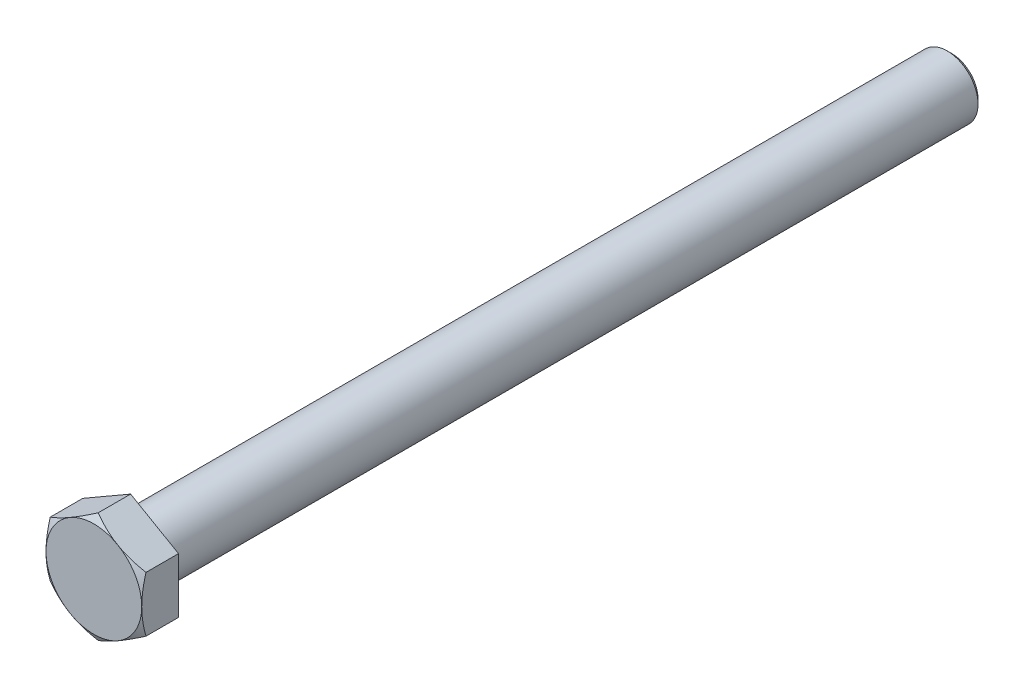
ISO-10303-21;
HEADER;
FILE_DESCRIPTION(('STEP AP214'),'2;1');
FILE_NAME('part.step','',(''),(''),'','','');
FILE_SCHEMA(('AUTOMOTIVE_DESIGN { 1 0 10303 214 1 1 1 1 }'));
ENDSEC;
DATA;
#1=APPLICATION_CONTEXT('core data for automotive mechanical design processes');
#2=APPLICATION_PROTOCOL_DEFINITION('international standard','automotive_design',2000,#1);
#3=PRODUCT_CONTEXT('',#1,'mechanical');
#4=PRODUCT('Part','Part','',(#3));
#5=PRODUCT_RELATED_PRODUCT_CATEGORY('part','',(#4));
#6=PRODUCT_DEFINITION_FORMATION('','',#4);
#7=PRODUCT_DEFINITION_CONTEXT('part definition',#1,'design');
#8=PRODUCT_DEFINITION('design','',#6,#7);
#9=PRODUCT_DEFINITION_SHAPE('','',#8);
#10=(LENGTH_UNIT() NAMED_UNIT(*) SI_UNIT(.MILLI.,.METRE.));
#11=(NAMED_UNIT(*) PLANE_ANGLE_UNIT() SI_UNIT($,.RADIAN.));
#12=(NAMED_UNIT(*) SI_UNIT($,.STERADIAN.) SOLID_ANGLE_UNIT());
#13=UNCERTAINTY_MEASURE_WITH_UNIT(LENGTH_MEASURE(1.E-05),#10,'distance_accuracy_value','');
#14=(GEOMETRIC_REPRESENTATION_CONTEXT(3) GLOBAL_UNCERTAINTY_ASSIGNED_CONTEXT((#13)) GLOBAL_UNIT_ASSIGNED_CONTEXT((#10,
#11,#12)) REPRESENTATION_CONTEXT('',''));
#15=CARTESIAN_POINT('',(0.,0.,0.));
#16=DIRECTION('',(0.,0.,1.));
#17=DIRECTION('',(1.,0.,0.));
#18=AXIS2_PLACEMENT_3D('',#15,#16,#17);
#19=CARTESIAN_POINT('',(0.,0.,0.));
#20=DIRECTION('',(0.,0.,1.));
#21=DIRECTION('',(1.,0.,0.));
#22=AXIS2_PLACEMENT_3D('',#19,#20,#21);
#23=PLANE('',#22);
#24=CARTESIAN_POINT('',(0.,0.,0.));
#25=DIRECTION('',(0.,0.,1.));
#26=DIRECTION('',(1.,0.,0.));
#27=AXIS2_PLACEMENT_3D('',#24,#25,#26);
#28=CIRCLE('',#27,6.6);
#29=CARTESIAN_POINT('',(6.6,0.,0.));
#30=VERTEX_POINT('',#29);
#31=EDGE_CURVE('E198',#30,#30,#28,.T.);
#32=ORIENTED_EDGE('',*,*,#31,.T.);
#33=EDGE_LOOP('',(#32));
#34=FACE_BOUND('',#33,.T.);
#35=CARTESIAN_POINT('',(0.,0.,0.));
#36=DIRECTION('',(0.,0.,1.));
#37=DIRECTION('',(1.,0.,0.));
#38=AXIS2_PLACEMENT_3D('',#35,#36,#37);
#39=CIRCLE('',#38,8.7);
#40=CARTESIAN_POINT('',(8.7,0.,0.));
#41=VERTEX_POINT('',#40);
#42=EDGE_CURVE('E413',#41,#41,#39,.T.);
#43=ORIENTED_EDGE('',*,*,#42,.F.);
#44=EDGE_LOOP('',(#43));
#45=FACE_BOUND('',#44,.T.);
#46=ADVANCED_FACE('F59',(#34,#45),#23,.F.);
#47=CARTESIAN_POINT('',(0.,-1.33226762955019E-12,-0.599999999999934));
#48=DIRECTION('',(0.,0.,1.));
#49=DIRECTION('',(1.,0.,0.));
#50=AXIS2_PLACEMENT_3D('',#47,#48,#49);
#51=TOROIDAL_SURFACE('',#50,6.6,0.6);
#52=ORIENTED_EDGE('',*,*,#31,.F.);
#53=EDGE_LOOP('',(#52));
#54=FACE_BOUND('',#53,.T.);
#55=CARTESIAN_POINT('',(0.,-1.33226762955019E-12,-0.599999999999934));
#56=DIRECTION('',(0.,0.,1.));
#57=DIRECTION('',(1.,0.,0.));
#58=AXIS2_PLACEMENT_3D('',#55,#56,#57);
#59=CIRCLE('',#58,6.00000000000001);
#60=CARTESIAN_POINT('',(6.00000000000001,-1.33226762955019E-12,-0.599999999999937));
#61=VERTEX_POINT('',#60);
#62=EDGE_CURVE('E202',#61,#61,#59,.T.);
#63=ORIENTED_EDGE('',*,*,#62,.T.);
#64=EDGE_LOOP('',(#63));
#65=FACE_BOUND('',#64,.T.);
#66=ADVANCED_FACE('F294',(#54,#65),#51,.F.);
#67=CARTESIAN_POINT('',(0.,0.,0.));
#68=DIRECTION('',(0.,0.,1.));
#69=DIRECTION('',(1.,0.,0.));
#70=AXIS2_PLACEMENT_3D('',#67,#68,#69);
#71=CYLINDRICAL_SURFACE('',#70,6.00000000000001);
#72=ORIENTED_EDGE('',*,*,#62,.F.);
#73=EDGE_LOOP('',(#72));
#74=FACE_BOUND('',#73,.T.);
#75=CARTESIAN_POINT('',(-2.22044604925031E-13,8.88178419700125E-13,-159.099999999996));
#76=DIRECTION('',(0.,0.,1.));
#77=DIRECTION('',(1.,0.,0.));
#78=AXIS2_PLACEMENT_3D('',#75,#76,#77);
#79=CIRCLE('',#78,6.00000000000002);
#80=CARTESIAN_POINT('',(5.9999999999998,8.88178419700125E-13,-159.099999999996));
#81=VERTEX_POINT('',#80);
#82=EDGE_CURVE('E206',#81,#81,#79,.T.);
#83=ORIENTED_EDGE('',*,*,#82,.T.);
#84=EDGE_LOOP('',(#83));
#85=FACE_BOUND('',#84,.T.);
#86=ADVANCED_FACE('F300',(#74,#85),#71,.T.);
#87=CARTESIAN_POINT('',(4.44089209850063E-13,4.21884749357559E-12,-159.999999999996));
#88=DIRECTION('',(0.,0.,1.));
#89=DIRECTION('',(1.,0.,0.));
#90=AXIS2_PLACEMENT_3D('',#87,#88,#89);
#91=CONICAL_SURFACE('',#90,5.1,0.785398163397439);
#92=ORIENTED_EDGE('',*,*,#82,.F.);
#93=EDGE_LOOP('',(#92));
#94=FACE_BOUND('',#93,.T.);
#95=CARTESIAN_POINT('',(4.44089209850063E-13,4.21884749357559E-12,-159.999999999996));
#96=DIRECTION('',(0.,0.,1.));
#97=DIRECTION('',(1.,0.,0.));
#98=AXIS2_PLACEMENT_3D('',#95,#96,#97);
#99=CIRCLE('',#98,5.1);
#100=CARTESIAN_POINT('',(5.10000000000044,4.21884749357559E-12,-159.999999999996));
#101=VERTEX_POINT('',#100);
#102=EDGE_CURVE('E168',#101,#101,#99,.T.);
#103=ORIENTED_EDGE('',*,*,#102,.T.);
#104=EDGE_LOOP('',(#103));
#105=FACE_BOUND('',#104,.T.);
#106=ADVANCED_FACE('F503',(#94,#105),#91,.T.);
#107=CARTESIAN_POINT('',(-4.44089209850063E-13,5.10000000000055,-159.999999999997));
#108=DIRECTION('',(0.,0.,1.));
#109=DIRECTION('',(1.,0.,0.));
#110=AXIS2_PLACEMENT_3D('',#107,#108,#109);
#111=PLANE('',#110);
#112=ORIENTED_EDGE('',*,*,#102,.F.);
#113=EDGE_LOOP('',(#112));
#114=FACE_BOUND('',#113,.T.);
#115=ADVANCED_FACE('F470',(#114),#111,.F.);
#116=CARTESIAN_POINT('',(2.22044604925031E-13,10.7791295257711,0.14999999999965));
#117=DIRECTION('',(0.,0.,-1.));
#118=DIRECTION('',(-1.,0.,0.));
#119=AXIS2_PLACEMENT_3D('',#116,#117,#118);
#120=PLANE('',#119);
#121=CARTESIAN_POINT('',(6.66133814775094E-13,1.33226762955019E-12,0.150000000000095));
#122=DIRECTION('',(0.,0.,1.));
#123=DIRECTION('',(1.,0.,0.));
#124=AXIS2_PLACEMENT_3D('',#121,#122,#123);
#125=CIRCLE('',#124,8.78660254037844);
#126=CARTESIAN_POINT('',(8.78660254037911,1.33226762955019E-12,0.15000000000009));
#127=VERTEX_POINT('',#126);
#128=EDGE_CURVE('E407',#127,#127,#125,.T.);
#129=ORIENTED_EDGE('',*,*,#128,.T.);
#130=EDGE_LOOP('',(#129));
#131=FACE_BOUND('',#130,.T.);
#132=DIRECTION('',(0.866025403784439,-0.5,0.));
#133=VECTOR('',#132,1.);
#134=CARTESIAN_POINT('',(9.33500000000009,5.38956476288632,0.150000000003203));
#135=LINE('',#134,#133);
#136=CARTESIAN_POINT('',(2.22044604925031E-13,10.7791295257711,0.14999999999965));
#137=VERTEX_POINT('',#136);
#138=CARTESIAN_POINT('',(9.33500000000009,5.38956476288632,0.150000000003203));
#139=VERTEX_POINT('',#138);
#140=EDGE_CURVE('E87',#137,#139,#135,.T.);
#141=ORIENTED_EDGE('',*,*,#140,.T.);
#142=DIRECTION('',(0.,-1.,0.));
#143=VECTOR('',#142,1.);
#144=CARTESIAN_POINT('',(9.33500000000032,-5.38956476288432,0.150000000000095));
#145=LINE('',#144,#143);
#146=CARTESIAN_POINT('',(9.33500000000032,-5.38956476288432,0.150000000000095));
#147=VERTEX_POINT('',#146);
#148=EDGE_CURVE('E11',#139,#147,#145,.T.);
#149=ORIENTED_EDGE('',*,*,#148,.T.);
#150=DIRECTION('',(-0.866025403784441,-0.5,0.));
#151=VECTOR('',#150,1.);
#152=CARTESIAN_POINT('',(4.44089209850063E-13,-10.77912952577,0.150000000003647));
#153=LINE('',#152,#151);
#154=CARTESIAN_POINT('',(4.44089209850063E-13,-10.77912952577,0.150000000003647));
#155=VERTEX_POINT('',#154);
#156=EDGE_CURVE('E218',#147,#155,#153,.T.);
#157=ORIENTED_EDGE('',*,*,#156,.T.);
#158=DIRECTION('',(-0.866025403784439,0.5,0.));
#159=VECTOR('',#158,1.);
#160=CARTESIAN_POINT('',(-9.33499999999965,-5.38956476288321,0.150000000000095));
#161=LINE('',#160,#159);
#162=CARTESIAN_POINT('',(-9.33499999999965,-5.38956476288321,0.150000000000095));
#163=VERTEX_POINT('',#162);
#164=EDGE_CURVE('E215',#155,#163,#161,.T.);
#165=ORIENTED_EDGE('',*,*,#164,.T.);
#166=DIRECTION('',(0.,1.,0.));
#167=VECTOR('',#166,1.);
#168=CARTESIAN_POINT('',(-9.33499999999965,5.38956476288588,0.14999999999965));
#169=LINE('',#168,#167);
#170=CARTESIAN_POINT('',(-9.33499999999965,5.38956476288588,0.14999999999965));
#171=VERTEX_POINT('',#170);
#172=EDGE_CURVE('E152',#163,#171,#169,.T.);
#173=ORIENTED_EDGE('',*,*,#172,.T.);
#174=DIRECTION('',(0.86602540378444,0.5,0.));
#175=VECTOR('',#174,1.);
#176=CARTESIAN_POINT('',(2.22044604925031E-13,10.7791295257711,0.14999999999965));
#177=LINE('',#176,#175);
#178=EDGE_CURVE('E149',#171,#137,#177,.T.);
#179=ORIENTED_EDGE('',*,*,#178,.T.);
#180=EDGE_LOOP('',(#141,#149,#157,#165,#173,#179));
#181=FACE_BOUND('',#180,.T.);
#182=ADVANCED_FACE('F150',(#131,#181),#120,.T.);
#183=CARTESIAN_POINT('',(6.66133814775094E-13,1.33226762955019E-12,0.150000000000095));
#184=DIRECTION('',(0.,0.,1.));
#185=DIRECTION('',(1.,0.,0.));
#186=AXIS2_PLACEMENT_3D('',#183,#184,#185);
#187=CONICAL_SURFACE('',#186,8.78660254037844,0.5235987755983);
#188=ORIENTED_EDGE('',*,*,#42,.T.);
#189=EDGE_LOOP('',(#188));
#190=FACE_BOUND('',#189,.T.);
#191=ORIENTED_EDGE('',*,*,#128,.F.);
#192=EDGE_LOOP('',(#191));
#193=FACE_BOUND('',#192,.T.);
#194=ADVANCED_FACE('F244',(#190,#193),#187,.T.);
#195=CARTESIAN_POINT('',(9.33500000000009,-5.38956476288388,7.31999999999999));
#196=DIRECTION('',(-1.,0.,0.));
#197=DIRECTION('',(0.,-1.,0.));
#198=AXIS2_PLACEMENT_3D('',#195,#196,#197);
#199=PLANE('',#198);
#200=CARTESIAN_POINT('',(9.33500000000054,-14.2939200065677,2.8529532059296));
#201=CARTESIAN_POINT('',(9.33500000000026,-14.0889979748914,2.95200947810429));
#202=CARTESIAN_POINT('',(9.33500000000014,-13.883828250142,3.05055309057784));
#203=CARTESIAN_POINT('',(9.33500000000006,-13.4729410981214,3.24649731903083));
#204=CARTESIAN_POINT('',(9.33500000000008,-13.2672236648763,3.34389792248024));
#205=CARTESIAN_POINT('',(9.33500000000013,-12.6491110540914,3.63423693699367));
#206=CARTESIAN_POINT('',(9.33500000000011,-12.2358221904241,3.82528025363531));
#207=CARTESIAN_POINT('',(9.33500000000009,-11.4040234451094,4.20217310927));
#208=CARTESIAN_POINT('',(9.33500000000009,-10.9854972201124,4.38798667006424));
#209=CARTESIAN_POINT('',(9.3350000000001,-10.1450055951409,4.75163580727645));
#210=CARTESIAN_POINT('',(9.3350000000001,-9.72304037579275,4.92947179954992));
#211=CARTESIAN_POINT('',(9.33500000000009,-8.86976005799748,5.27715066645133));
#212=CARTESIAN_POINT('',(9.33500000000009,-8.43839377157332,5.44686860657153));
#213=CARTESIAN_POINT('',(9.3350000000001,-7.57057438678958,5.77301256488047));
#214=CARTESIAN_POINT('',(9.33500000000013,-7.13412072861191,5.92943710424788));
#215=CARTESIAN_POINT('',(9.33500000000006,-6.25632320664925,6.22479025996746));
#216=CARTESIAN_POINT('',(9.33499999999997,-5.81499199640056,6.36375607259893));
#217=CARTESIAN_POINT('',(9.33500000000021,-4.92607133486448,6.61968098547111));
#218=CARTESIAN_POINT('',(9.33500000000055,-4.47848391093586,6.73664704501688));
#219=CARTESIAN_POINT('',(9.33500000000052,-3.57667031207618,6.94288552890604));
#220=CARTESIAN_POINT('',(9.33500000000017,-3.1224424031369,7.03215057946406));
#221=CARTESIAN_POINT('',(9.33500000000005,-2.43710350689098,7.14080282116408));
#222=CARTESIAN_POINT('',(9.33500000000008,-2.20796291905894,7.17281503726107));
#223=CARTESIAN_POINT('',(9.3350000000001,-1.74860743174241,7.22779448910407));
#224=CARTESIAN_POINT('',(9.33500000000009,-1.51839264089987,7.25076262030647));
#225=CARTESIAN_POINT('',(9.33500000000008,-1.05866032543408,7.28703579916516));
#226=CARTESIAN_POINT('',(9.33500000000009,-0.829147554395675,7.30040085149519));
#227=CARTESIAN_POINT('',(9.33500000000009,-0.369761997155168,7.31739721140065));
#228=CARTESIAN_POINT('',(9.33500000000009,-0.139889215667101,7.321028645381));
#229=CARTESIAN_POINT('',(9.33500000000009,0.319737952099851,7.31847123986254));
#230=CARTESIAN_POINT('',(9.33500000000008,0.549492353500274,7.31228515639608));
#231=CARTESIAN_POINT('',(9.33500000000009,1.00854016574372,7.29024654738607));
#232=CARTESIAN_POINT('',(9.33500000000009,1.23783355299172,7.27439353911284));
#233=CARTESIAN_POINT('',(9.33500000000009,1.79357012506142,7.22458635459068));
#234=CARTESIAN_POINT('',(9.33500000000009,2.11958632863987,7.18578870330793));
#235=CARTESIAN_POINT('',(9.33500000000008,2.76912050376885,7.09080439036387));
#236=CARTESIAN_POINT('',(9.33500000000008,3.09263776869649,7.03461298239628));
#237=CARTESIAN_POINT('',(9.33500000000008,3.73690716836883,6.90683408562757));
#238=CARTESIAN_POINT('',(9.33500000000008,4.05765638834857,6.83523203973513));
#239=CARTESIAN_POINT('',(9.33500000000008,4.69585477456167,6.67881653034317));
#240=CARTESIAN_POINT('',(9.33500000000008,5.0133042486738,6.59400431142267));
#241=CARTESIAN_POINT('',(9.33500000000008,5.65272185352892,6.41098051072647));
#242=CARTESIAN_POINT('',(9.33500000000008,5.97461000805024,6.31249144069503));
#243=CARTESIAN_POINT('',(9.33500000000008,6.61498395116311,6.10578201115797));
#244=CARTESIAN_POINT('',(9.33500000000009,6.93347191931141,5.99756836371273));
#245=CARTESIAN_POINT('',(9.33500000000007,7.56576751363467,5.77364503844938));
#246=CARTESIAN_POINT('',(9.33500000000003,7.87959139359984,5.65798098174515));
#247=CARTESIAN_POINT('',(9.33500000000012,8.50480431543608,5.41986404687489));
#248=CARTESIAN_POINT('',(9.33500000000024,8.81619231437585,5.29740842489885));
#249=CARTESIAN_POINT('',(9.33500000000054,9.12644907510129,5.17222885599011));
#250=B_SPLINE_CURVE_WITH_KNOTS('',3,(#200,#201,#202,#203,#204,#205,#206,#207,#208,#209,#210,
#211,#212,#213,#214,#215,#216,#217,#218,#219,#220,#221,#222,#223,#224,#225,#226,#227,#228,#229,
#230,#231,#232,#233,#234,#235,#236,#237,#238,#239,#240,#241,#242,#243,#244,#245,#246,#247,#248,
#249),.UNSPECIFIED.,.F.,.F.,(4,2,2,2,2,2,2,2,2,2,2,2,2,2,2,2,2,2,2,2,2,2,2,2,4),(0.,
0.682821242992999,1.36564996430013,2.73152951663889,4.10522544602877,5.47884968385028,
6.86933776425735,8.2599803272584,9.64760794835924,11.0347958724528,12.4223527386741,
13.1163000222239,13.8101785806467,14.4996828280981,15.1891781213094,15.8784798895046,
16.5678160816441,17.5522174713337,18.5368877158492,19.5224922074124,20.5080038976517,
21.5176726092945,22.5266497067156,23.5299476031853,24.533653829807),.UNSPECIFIED.);
#251=CARTESIAN_POINT('',(9.33500000000032,-5.38956476288099,6.48623142955174));
#252=VERTEX_POINT('',#251);
#253=CARTESIAN_POINT('',(9.33500000000187,3.33066907387547E-12,7.31999999999999));
#254=VERTEX_POINT('',#253);
#255=EDGE_CURVE('E372',#252,#254,#250,.T.);
#256=ORIENTED_EDGE('',*,*,#255,.F.);
#257=DIRECTION('',(0.,0.,-1.));
#258=VECTOR('',#257,1.);
#259=CARTESIAN_POINT('',(9.33500000000009,-5.38956476288388,7.31999999999999));
#260=LINE('',#259,#258);
#261=EDGE_CURVE('E192',#252,#147,#260,.T.);
#262=ORIENTED_EDGE('',*,*,#261,.T.);
#263=ORIENTED_EDGE('',*,*,#148,.F.);
#264=DIRECTION('',(0.,0.,-1.));
#265=VECTOR('',#264,1.);
#266=CARTESIAN_POINT('',(9.33500000000054,5.38956476288943,7.32000000000355));
#267=LINE('',#266,#265);
#268=CARTESIAN_POINT('',(9.33500000000032,5.38956476288588,6.48623142955529));
#269=VERTEX_POINT('',#268);
#270=EDGE_CURVE('E166',#269,#139,#267,.T.);
#271=ORIENTED_EDGE('',*,*,#270,.F.);
#272=EDGE_CURVE('E249',#254,#269,#250,.T.);
#273=ORIENTED_EDGE('',*,*,#272,.F.);
#274=EDGE_LOOP('',(#256,#262,#263,#271,#273));
#275=FACE_BOUND('',#274,.T.);
#276=ADVANCED_FACE('F305',(#275),#199,.F.);
#277=CARTESIAN_POINT('',(4.44089209850063E-13,-10.7791295257693,7.32000000000355));
#278=DIRECTION('',(-0.5,0.86602540378444,0.));
#279=DIRECTION('',(-0.866025403784441,-0.5,0.));
#280=AXIS2_PLACEMENT_3D('',#277,#278,#279);
#281=PLANE('',#280);
#282=CARTESIAN_POINT('',(-0.000199999998118372,-10.7792449958235,6.48616476181374));
#283=CARTESIAN_POINT('',(0.205003739619134,-10.660770561516,6.55455498932982));
#284=CARTESIAN_POINT('',(0.410972586004757,-10.5418543926103,6.61984121047611));
#285=CARTESIAN_POINT('',(0.824561997185974,-10.3030684347306,6.74334436956233));
#286=CARTESIAN_POINT('',(1.03218308144235,-10.1831983458458,6.80155898242845));
#287=CARTESIAN_POINT('',(1.65839174727719,-9.82165660405732,6.96446882046107));
#288=CARTESIAN_POINT('',(2.07945137461496,-9.5785577148689,7.05713121773367));
#289=CARTESIAN_POINT('',(2.70954783258556,-9.21477135524413,7.16578659054222));
#290=CARTESIAN_POINT('',(2.91670220163521,-9.09517072450952,7.19673843664825));
#291=CARTESIAN_POINT('',(3.33197005561756,-8.855415717227,7.24864273857334));
#292=CARTESIAN_POINT('',(3.54008355893243,-8.73526133006613,7.26959500193518));
#293=CARTESIAN_POINT('',(3.95665771618434,-8.49475212823938,7.3009632905055));
#294=CARTESIAN_POINT('',(4.16511766131753,-8.3743977228016,7.31139183642488));
#295=CARTESIAN_POINT('',(4.5822301078775,-8.13357773949754,7.32149109381367));
#296=CARTESIAN_POINT('',(4.79088260315593,-8.01311216518102,7.32116213765502));
#297=CARTESIAN_POINT('',(5.1809638145184,-7.78789867279515,7.31049475072296));
#298=CARTESIAN_POINT('',(5.36242006195917,-7.68313485948946,7.30145760928891));
#299=CARTESIAN_POINT('',(5.72490816972206,-7.4738522528948,7.27542267819159));
#300=CARTESIAN_POINT('',(5.90593999911289,-7.36933347746402,7.25842432539975));
#301=CARTESIAN_POINT('',(6.44833403144256,-7.05618213689149,7.19588933549894));
#302=CARTESIAN_POINT('',(6.80873615765841,-6.84810387230432,7.13882055797777));
#303=CARTESIAN_POINT('',(7.53336341948468,-6.42974012762687,6.99614801219717));
#304=CARTESIAN_POINT('',(7.89749607658282,-6.21950804003055,6.90993947246132));
#305=CARTESIAN_POINT('',(8.62033129112772,-5.80217893433317,6.71428185815901));
#306=CARTESIAN_POINT('',(8.97904310475536,-5.5950765721736,6.60487873714884));
#307=CARTESIAN_POINT('',(9.33520000000021,-5.38944929282992,6.48616476181374));
#308=B_SPLINE_CURVE_WITH_KNOTS('',3,(#282,#283,#284,#285,#286,#287,#288,#289,#290,#291,#292,
#293,#294,#295,#296,#297,#298,#299,#300,#301,#302,#303,#304,#305,#306,#307),.UNSPECIFIED.,.F.,
.F.,(4,2,2,2,2,2,2,2,2,2,2,2,4),(0.,0.739804294915381,1.47985117544287,2.9630953277581,
3.68651340422444,4.40994540341471,5.13251567287096,5.85506361726829,6.48407412042886,
7.11312912275822,8.37213305715118,9.65905881820976,10.9434583334598),.UNSPECIFIED.);
#309=CARTESIAN_POINT('',(1.77635683940025E-12,-10.7791295257673,6.48623142955529));
#310=VERTEX_POINT('',#309);
#311=CARTESIAN_POINT('',(4.66750000000071,-8.08434714432682,7.31999999999999));
#312=VERTEX_POINT('',#311);
#313=EDGE_CURVE('E319',#310,#312,#308,.T.);
#314=ORIENTED_EDGE('',*,*,#313,.F.);
#315=DIRECTION('',(0.,0.,-1.));
#316=VECTOR('',#315,1.);
#317=CARTESIAN_POINT('',(4.44089209850063E-13,-10.7791295257693,7.32000000000355));
#318=LINE('',#317,#316);
#319=EDGE_CURVE('E188',#310,#155,#318,.T.);
#320=ORIENTED_EDGE('',*,*,#319,.T.);
#321=ORIENTED_EDGE('',*,*,#156,.F.);
#322=ORIENTED_EDGE('',*,*,#261,.F.);
#323=EDGE_CURVE('E259',#312,#252,#308,.T.);
#324=ORIENTED_EDGE('',*,*,#323,.F.);
#325=EDGE_LOOP('',(#314,#320,#321,#322,#324));
#326=FACE_BOUND('',#325,.T.);
#327=ADVANCED_FACE('F308',(#326),#281,.F.);
#328=CARTESIAN_POINT('',(-9.33499999999965,-5.38956476288033,7.31999999999999));
#329=DIRECTION('',(0.5,0.866025403784439,0.));
#330=DIRECTION('',(-0.866025403784439,0.5,0.));
#331=AXIS2_PLACEMENT_3D('',#328,#329,#330);
#332=PLANE('',#331);
#333=CARTESIAN_POINT('',(-9.33520000000021,-5.38944929283036,6.48616476181374));
#334=CARTESIAN_POINT('',(-9.12999626038169,-5.50792372713519,6.5545549893315));
#335=CARTESIAN_POINT('',(-8.92402741399541,-5.62683989603986,6.61984121047853));
#336=CARTESIAN_POINT('',(-8.51043800281349,-5.86562585391886,6.74334436956534));
#337=CARTESIAN_POINT('',(-8.30281691855707,-5.98549594280402,6.8015589824313));
#338=CARTESIAN_POINT('',(-7.67660825272223,-6.34703768459312,6.96446882046358));
#339=CARTESIAN_POINT('',(-7.25554862538435,-6.59013657378138,7.05713121773618));
#340=CARTESIAN_POINT('',(-6.62545216741346,-6.95392293340605,7.16578659054477));
#341=CARTESIAN_POINT('',(-6.41829779836363,-7.07352356414069,7.19673843665082));
#342=CARTESIAN_POINT('',(-6.00302994438119,-7.31327857142359,7.24864273857559));
#343=CARTESIAN_POINT('',(-5.79491644106639,-7.43343295858479,7.26959500193708));
#344=CARTESIAN_POINT('',(-5.37834228381375,-7.67394216041089,7.30096329050807));
#345=CARTESIAN_POINT('',(-5.16988233867974,-7.79429656584769,7.31139183642848));
#346=CARTESIAN_POINT('',(-4.75276989212112,-8.03511654915496,7.3214910938141));
#347=CARTESIAN_POINT('',(-4.54411739684485,-8.15558212347566,7.32116213765126));
#348=CARTESIAN_POINT('',(-4.15403618548167,-8.38079561586115,7.31049475071959));
#349=CARTESIAN_POINT('',(-3.97257993803867,-8.48555942916332,7.30145760928907));
#350=CARTESIAN_POINT('',(-3.61009183027411,-8.6948420357553,7.27542267819428));
#351=CARTESIAN_POINT('',(-3.42906000088385,-8.79936081118692,7.25842432540146));
#352=CARTESIAN_POINT('',(-2.88666596855523,-9.11251215176078,7.19588933549895));
#353=CARTESIAN_POINT('',(-2.52626384233914,-9.32059041634726,7.1388205579783));
#354=CARTESIAN_POINT('',(-1.80163658051289,-9.73895416102379,6.996148012198));
#355=CARTESIAN_POINT('',(-1.43750392341503,-9.9491862486199,6.90993947246193));
#356=CARTESIAN_POINT('',(-0.714668708870963,-10.3665153543178,6.71428185815914));
#357=CARTESIAN_POINT('',(-0.355956895243881,-10.5736177164781,6.6048787371487));
#358=CARTESIAN_POINT('',(0.000200000000116773,-10.7792449958231,6.48616476181374));
#359=B_SPLINE_CURVE_WITH_KNOTS('',3,(#333,#334,#335,#336,#337,#338,#339,#340,#341,#342,#343,
#344,#345,#346,#347,#348,#349,#350,#351,#352,#353,#354,#355,#356,#357,#358),.UNSPECIFIED.,.F.,
.F.,(4,2,2,2,2,2,2,2,2,2,2,2,4),(0.,0.739804294916068,1.47985117544409,2.96309532775943,
3.68651340422625,4.40994540341682,5.13251567287365,5.85506361727179,6.48407412043251,
7.11312912276178,8.37213305715433,9.65905881821197,10.9434583334618),.UNSPECIFIED.);
#360=CARTESIAN_POINT('',(-9.33499999999898,-5.38956476288388,6.48623142955174));
#361=VERTEX_POINT('',#360);
#362=CARTESIAN_POINT('',(-4.66750000000005,-8.08434714432704,7.31999999999999));
#363=VERTEX_POINT('',#362);
#364=EDGE_CURVE('E281',#361,#363,#359,.T.);
#365=ORIENTED_EDGE('',*,*,#364,.F.);
#366=DIRECTION('',(0.,0.,-1.));
#367=VECTOR('',#366,1.);
#368=CARTESIAN_POINT('',(-9.33499999999965,-5.38956476288033,7.31999999999999));
#369=LINE('',#368,#367);
#370=EDGE_CURVE('E182',#361,#163,#369,.T.);
#371=ORIENTED_EDGE('',*,*,#370,.T.);
#372=ORIENTED_EDGE('',*,*,#164,.F.);
#373=ORIENTED_EDGE('',*,*,#319,.F.);
#374=EDGE_CURVE('E267',#363,#310,#359,.T.);
#375=ORIENTED_EDGE('',*,*,#374,.F.);
#376=EDGE_LOOP('',(#365,#371,#372,#373,#375));
#377=FACE_BOUND('',#376,.T.);
#378=ADVANCED_FACE('F285',(#377),#332,.F.);
#379=CARTESIAN_POINT('',(-9.33499999999921,5.38956476288965,7.31999999999999));
#380=DIRECTION('',(1.,0.,0.));
#381=DIRECTION('',(0.,0.,-1.));
#382=AXIS2_PLACEMENT_3D('',#379,#380,#381);
#383=PLANE('',#382);
#384=CARTESIAN_POINT('',(-9.33499999999854,-14.2939200065666,2.8529532059296));
#385=CARTESIAN_POINT('',(-9.33499999999896,-14.0889979748903,2.95200947810458));
#386=CARTESIAN_POINT('',(-9.33499999999914,-13.883828250141,3.05055309057827));
#387=CARTESIAN_POINT('',(-9.33499999999927,-13.4729410981203,3.24649731903138));
#388=CARTESIAN_POINT('',(-9.33499999999923,-13.2672236648752,3.34389792248079));
#389=CARTESIAN_POINT('',(-9.33499999999916,-12.6491110540901,3.63423693699422));
#390=CARTESIAN_POINT('',(-9.33499999999919,-12.2358221904227,3.82528025363592));
#391=CARTESIAN_POINT('',(-9.33499999999922,-11.4040234451079,4.20217310927067));
#392=CARTESIAN_POINT('',(-9.33499999999921,-10.9854972201108,4.38798667006491));
#393=CARTESIAN_POINT('',(-9.3349999999992,-10.1450055951392,4.75163580727713));
#394=CARTESIAN_POINT('',(-9.3349999999992,-9.72304037579108,4.9294717995506));
#395=CARTESIAN_POINT('',(-9.33499999999921,-8.86976005799578,5.277150666452));
#396=CARTESIAN_POINT('',(-9.33499999999922,-8.43839377157162,5.44686860657219));
#397=CARTESIAN_POINT('',(-9.3349999999992,-7.57057438678789,5.77301256488106));
#398=CARTESIAN_POINT('',(-9.33499999999917,-7.13412072861024,5.92943710424842));
#399=CARTESIAN_POINT('',(-9.33499999999924,-6.25632320664758,6.22479025996802));
#400=CARTESIAN_POINT('',(-9.33499999999933,-5.81499199639887,6.36375607259956));
#401=CARTESIAN_POINT('',(-9.33499999999908,-4.92607133486265,6.61968098547146));
#402=CARTESIAN_POINT('',(-9.33499999999875,-4.47848391093392,6.7366470450169));
#403=CARTESIAN_POINT('',(-9.33499999999877,-3.57667031207399,6.94288552890606));
#404=CARTESIAN_POINT('',(-9.33499999999913,-3.12244240313458,7.0321505794644));
#405=CARTESIAN_POINT('',(-9.33499999999924,-2.43710350688842,7.14080282116448));
#406=CARTESIAN_POINT('',(-9.33499999999922,-2.20796291905631,7.17281503726143));
#407=CARTESIAN_POINT('',(-9.33499999999919,-1.74860743173963,7.22779448910434));
#408=CARTESIAN_POINT('',(-9.33499999999921,-1.51839264089702,7.25076262030671));
#409=CARTESIAN_POINT('',(-9.33499999999921,-1.05866032543106,7.28703579916536));
#410=CARTESIAN_POINT('',(-9.33499999999919,-0.829147554392563,7.30040085149539));
#411=CARTESIAN_POINT('',(-9.33499999999922,-0.369761997151893,7.31739721140065));
#412=CARTESIAN_POINT('',(-9.33499999999925,-0.139889215663762,7.32102864538082));
#413=CARTESIAN_POINT('',(-9.33499999999916,0.319737952103415,7.31847123986266));
#414=CARTESIAN_POINT('',(-9.33499999999905,0.549492353504,7.31228515639668));
#415=CARTESIAN_POINT('',(-9.33499999999936,1.0085401657476,7.29024654738508));
#416=CARTESIAN_POINT('',(-9.33499999999979,1.23783355299559,7.27439353910977));
#417=CARTESIAN_POINT('',(-9.33499999999999,1.79357012506547,7.22458635458646));
#418=CARTESIAN_POINT('',(-9.33499999999942,2.11958632864427,7.18578870330634));
#419=CARTESIAN_POINT('',(-9.33499999999899,2.76912050377347,7.09080439036411));
#420=CARTESIAN_POINT('',(-9.33499999999915,3.092637768701,7.03461298239571));
#421=CARTESIAN_POINT('',(-9.33499999999926,3.73690716837313,6.90683408562635));
#422=CARTESIAN_POINT('',(-9.33499999999922,4.05765638835278,6.83523203973407));
#423=CARTESIAN_POINT('',(-9.33499999999919,4.69585477456573,6.67881653034216));
#424=CARTESIAN_POINT('',(-9.3349999999992,5.01330424867779,6.59400431142157));
#425=CARTESIAN_POINT('',(-9.33499999999921,5.65272185353267,6.41098051072532));
#426=CARTESIAN_POINT('',(-9.3349999999992,5.97461000805381,6.31249144069394));
#427=CARTESIAN_POINT('',(-9.33499999999921,6.61498395116631,6.10578201115685));
#428=CARTESIAN_POINT('',(-9.33499999999922,6.9334719193144,5.99756836371152));
#429=CARTESIAN_POINT('',(-9.33499999999919,7.56576751363762,5.77364503844845));
#430=CARTESIAN_POINT('',(-9.33499999999916,7.87959139360295,5.65798098174458));
#431=CARTESIAN_POINT('',(-9.33499999999925,8.50480431543874,5.41986404687322));
#432=CARTESIAN_POINT('',(-9.33499999999937,8.81619231437792,5.29740842489572));
#433=CARTESIAN_POINT('',(-9.33499999999965,9.12644907510196,5.17222885598345));
#434=B_SPLINE_CURVE_WITH_KNOTS('',3,(#384,#385,#386,#387,#388,#389,#390,#391,#392,#393,#394,
#395,#396,#397,#398,#399,#400,#401,#402,#403,#404,#405,#406,#407,#408,#409,#410,#411,#412,#413,
#414,#415,#416,#417,#418,#419,#420,#421,#422,#423,#424,#425,#426,#427,#428,#429,#430,#431,#432,
#433),.UNSPECIFIED.,.F.,.F.,(4,2,2,2,2,2,2,2,2,2,2,2,2,2,2,2,2,2,2,2,2,2,2,2,4),(0.,
0.682821242993155,1.36564996430044,2.73152951663949,4.10522544602949,5.47884968385112,
6.86933776425815,8.25998032725914,9.64760794836006,11.0347958724538,12.4223527386756,
13.1163000222256,13.8101785806486,14.4996828281002,15.1891781213118,15.8784798895074,
16.5678160816473,17.5522174713372,18.5368877158525,19.5224922074154,20.5080038976546,
21.5176726092969,22.5266497067175,23.5299476031872,24.5336538298089),.UNSPECIFIED.);
#435=CARTESIAN_POINT('',(-9.33499999999965,5.38956476288588,6.48623142955174));
#436=VERTEX_POINT('',#435);
#437=CARTESIAN_POINT('',(-9.33499999999854,2.88657986402541E-12,7.31999999999999));
#438=VERTEX_POINT('',#437);
#439=EDGE_CURVE('E280',#436,#438,#434,.F.);
#440=ORIENTED_EDGE('',*,*,#439,.F.);
#441=DIRECTION('',(0.,0.,-1.));
#442=VECTOR('',#441,1.);
#443=CARTESIAN_POINT('',(-9.33499999999921,5.38956476288965,7.31999999999999));
#444=LINE('',#443,#442);
#445=EDGE_CURVE('E175',#436,#171,#444,.T.);
#446=ORIENTED_EDGE('',*,*,#445,.T.);
#447=ORIENTED_EDGE('',*,*,#172,.F.);
#448=ORIENTED_EDGE('',*,*,#370,.F.);
#449=EDGE_CURVE('E273',#438,#361,#434,.F.);
#450=ORIENTED_EDGE('',*,*,#449,.F.);
#451=EDGE_LOOP('',(#440,#446,#447,#448,#450));
#452=FACE_BOUND('',#451,.T.);
#453=ADVANCED_FACE('F282',(#452),#383,.F.);
#454=CARTESIAN_POINT('',(2.66453525910038E-12,10.7791295257729,7.31999999999999));
#455=DIRECTION('',(0.5,-0.86602540378444,0.));
#456=DIRECTION('',(0.86602540378444,0.5,0.));
#457=AXIS2_PLACEMENT_3D('',#454,#455,#456);
#458=PLANE('',#457);
#459=CARTESIAN_POINT('',(0.000200000000560863,10.7792449958264,6.48616476181374));
#460=CARTESIAN_POINT('',(-0.205003739616152,10.6607705615194,6.55455498933336));
#461=CARTESIAN_POINT('',(-0.410972586001667,10.5418543926138,6.61984121048121));
#462=CARTESIAN_POINT('',(-0.824561997182983,10.3030684347341,6.74334436956868));
#463=CARTESIAN_POINT('',(-1.03218308143956,10.1831983458492,6.80155898243449));
#464=CARTESIAN_POINT('',(-1.65839174727444,9.82165660406064,6.96446882046651));
#465=CARTESIAN_POINT('',(-2.07945137461193,9.57855771487241,7.05713121773926));
#466=CARTESIAN_POINT('',(-2.70954783258237,9.21477135524773,7.16578659054808));
#467=CARTESIAN_POINT('',(-2.91670220163209,9.09517072451306,7.1967384366542));
#468=CARTESIAN_POINT('',(-3.33197005561452,8.85541571723053,7.24864273857888));
#469=CARTESIAN_POINT('',(-3.54008355892939,8.73526133006971,7.2695950019402));
#470=CARTESIAN_POINT('',(-3.95665771618138,8.49475212824278,7.30096329051185));
#471=CARTESIAN_POINT('',(-4.16511766131464,8.37439772280476,7.31139183643307));
#472=CARTESIAN_POINT('',(-4.58223010787517,8.1335777395009,7.32149109381667));
#473=CARTESIAN_POINT('',(-4.79088260315407,8.0131121651848,7.321162137651));
#474=CARTESIAN_POINT('',(-5.1809638145171,7.7878986727985,7.31049475071981));
#475=CARTESIAN_POINT('',(-5.362420061958,7.68313485949213,7.30145760929184));
#476=CARTESIAN_POINT('',(-5.72490816972112,7.47385225289687,7.27542267819898));
#477=CARTESIAN_POINT('',(-5.90593999911204,7.36933347746618,7.25842432540554));
#478=CARTESIAN_POINT('',(-6.44833403144185,7.05618213689383,7.19588933550198));
#479=CARTESIAN_POINT('',(-6.80873615765772,6.84810387230657,7.13882055798171));
#480=CARTESIAN_POINT('',(-7.53336341948381,6.42974012762902,6.99614801220185));
#481=CARTESIAN_POINT('',(-7.89749607658175,6.21950804003268,6.90993947246583));
#482=CARTESIAN_POINT('',(-8.6203312911267,5.80217893433575,6.71428185816207));
#483=CARTESIAN_POINT('',(-8.97904310475459,5.59507657217664,6.6048787371506));
#484=CARTESIAN_POINT('',(-9.33519999999977,5.38944929283414,6.48616476181374));
#485=B_SPLINE_CURVE_WITH_KNOTS('',3,(#459,#460,#461,#462,#463,#464,#465,#466,#467,#468,#469,
#470,#471,#472,#473,#474,#475,#476,#477,#478,#479,#480,#481,#482,#483,#484),.UNSPECIFIED.,.F.,
.F.,(4,2,2,2,2,2,2,2,2,2,2,2,4),(0.,0.73980429491614,1.4798511754441,2.96309532775857,
3.68651340422517,4.40994540341539,5.1325156728721,5.85506361727028,6.48407412043156,
7.11312912276122,8.37213305715435,9.6590588182124,10.9434583334632),.UNSPECIFIED.);
#486=CARTESIAN_POINT('',(8.88178419700125E-13,10.7791295257711,6.48623142955174));
#487=VERTEX_POINT('',#486);
#488=CARTESIAN_POINT('',(-4.66749999999805,8.08434714433126,7.31999999999999));
#489=VERTEX_POINT('',#488);
#490=EDGE_CURVE('E173',#487,#489,#485,.T.);
#491=ORIENTED_EDGE('',*,*,#490,.F.);
#492=DIRECTION('',(0.,0.,-1.));
#493=VECTOR('',#492,1.);
#494=CARTESIAN_POINT('',(2.66453525910038E-12,10.7791295257729,7.31999999999999));
#495=LINE('',#494,#493);
#496=EDGE_CURVE('E164',#487,#137,#495,.T.);
#497=ORIENTED_EDGE('',*,*,#496,.T.);
#498=ORIENTED_EDGE('',*,*,#178,.F.);
#499=ORIENTED_EDGE('',*,*,#445,.F.);
#500=EDGE_CURVE('E230',#489,#436,#485,.T.);
#501=ORIENTED_EDGE('',*,*,#500,.F.);
#502=EDGE_LOOP('',(#491,#497,#498,#499,#501));
#503=FACE_BOUND('',#502,.T.);
#504=ADVANCED_FACE('F171',(#503),#458,.F.);
#505=CARTESIAN_POINT('',(9.33500000000054,5.38956476288943,7.32000000000355));
#506=DIRECTION('',(-0.5,-0.866025403784439,0.));
#507=DIRECTION('',(0.866025403784439,-0.5,0.));
#508=AXIS2_PLACEMENT_3D('',#505,#506,#507);
#509=PLANE('',#508);
#510=CARTESIAN_POINT('',(9.33519999999999,5.38944929283014,6.48616476181418));
#511=CARTESIAN_POINT('',(9.12999626038425,5.50792372713964,6.55455498933181));
#512=CARTESIAN_POINT('',(8.92402741399922,5.62683989604626,6.61984121047882));
#513=CARTESIAN_POINT('',(8.5104380028184,5.86562585392666,6.74334436956568));
#514=CARTESIAN_POINT('',(8.30281691856183,5.98549594281126,6.80155898243171));
#515=CARTESIAN_POINT('',(7.676608252727,6.34703768459925,6.96446882046416));
#516=CARTESIAN_POINT('',(7.25554862538966,6.59013657378761,7.05713121773685));
#517=CARTESIAN_POINT('',(6.62545216741947,6.95392293341235,7.16578659054576));
#518=CARTESIAN_POINT('',(6.41829779836983,7.07352356414701,7.19673843665195));
#519=CARTESIAN_POINT('',(6.00302994438743,7.31327857142932,7.24864273857684));
#520=CARTESIAN_POINT('',(5.79491644107249,7.43343295858992,7.26959500193831));
#521=CARTESIAN_POINT('',(5.37834228382094,7.67394216041732,7.3009632905099));
#522=CARTESIAN_POINT('',(5.16988233868818,7.79429656585602,7.31139183643093));
#523=CARTESIAN_POINT('',(4.75276989212665,8.0351165491578,7.32149109381549));
#524=CARTESIAN_POINT('',(4.54411739684624,8.15558212347112,7.32116213765098));
#525=CARTESIAN_POINT('',(4.15403618548351,8.38079561585778,7.31049475071983));
#526=CARTESIAN_POINT('',(3.972579938044,8.48555942916658,7.30145760929101));
#527=CARTESIAN_POINT('',(3.61009183028185,8.69484203576371,7.27542267819762));
#528=CARTESIAN_POINT('',(3.42906000089051,8.79936081119385,7.25842432540449));
#529=CARTESIAN_POINT('',(2.88666596855992,9.11251215176537,7.19588933550154));
#530=CARTESIAN_POINT('',(2.52626384234415,9.32059041635313,7.13882055798123));
#531=CARTESIAN_POINT('',(1.801636580518,9.73895416103132,6.99614801220147));
#532=CARTESIAN_POINT('',(1.43750392341988,9.94918624862778,6.9099394724656));
#533=CARTESIAN_POINT('',(0.714668708874354,10.3665153543244,6.71428185816206));
#534=CARTESIAN_POINT('',(0.355956895246066,10.5736177164831,6.60487873715068));
#535=CARTESIAN_POINT('',(-0.000199999999672684,10.7792449958248,6.48616476181374));
#536=B_SPLINE_CURVE_WITH_KNOTS('',3,(#510,#511,#512,#513,#514,#515,#516,#517,#518,#519,#520,
#521,#522,#523,#524,#525,#526,#527,#528,#529,#530,#531,#532,#533,#534,#535),.UNSPECIFIED.,.F.,
.F.,(4,2,2,2,2,2,2,2,2,2,2,2,4),(0.,0.739804294915748,1.4798511754434,2.96309532775757,
3.68651340422397,4.40994540341404,5.13251567287051,5.85506361726839,6.4840741204298,
7.11312912275966,8.37213305715327,9.65905881821186,10.943458333463),.UNSPECIFIED.);
#537=CARTESIAN_POINT('',(4.66750000000071,8.08434714432948,7.31999999999999));
#538=VERTEX_POINT('',#537);
#539=EDGE_CURVE('E221',#269,#538,#536,.T.);
#540=ORIENTED_EDGE('',*,*,#539,.F.);
#541=ORIENTED_EDGE('',*,*,#270,.T.);
#542=ORIENTED_EDGE('',*,*,#140,.F.);
#543=ORIENTED_EDGE('',*,*,#496,.F.);
#544=EDGE_CURVE('E222',#538,#487,#536,.T.);
#545=ORIENTED_EDGE('',*,*,#544,.F.);
#546=EDGE_LOOP('',(#540,#541,#542,#543,#545));
#547=FACE_BOUND('',#546,.T.);
#548=ADVANCED_FACE('F61',(#547),#509,.F.);
#549=CARTESIAN_POINT('',(4.44089209850063E-13,6.66133814775094E-12,7.31999999999999));
#550=DIRECTION('',(0.,0.,-1.));
#551=DIRECTION('',(-1.,0.,0.));
#552=AXIS2_PLACEMENT_3D('',#549,#550,#551);
#553=CONICAL_SURFACE('',#552,9.335,1.0471975511966);
#554=ORIENTED_EDGE('',*,*,#323,.T.);
#555=ORIENTED_EDGE('',*,*,#255,.T.);
#556=CARTESIAN_POINT('',(4.44089209850063E-13,6.66133814775094E-12,7.31999999999999));
#557=DIRECTION('',(0.,0.,1.));
#558=DIRECTION('',(1.,0.,0.));
#559=AXIS2_PLACEMENT_3D('',#556,#557,#558);
#560=CIRCLE('',#559,9.335);
#561=EDGE_CURVE('E79',#312,#254,#560,.T.);
#562=ORIENTED_EDGE('',*,*,#561,.F.);
#563=EDGE_LOOP('',(#554,#555,#562));
#564=FACE_BOUND('',#563,.T.);
#565=ADVANCED_FACE('F243',(#564),#553,.T.);
#566=ORIENTED_EDGE('',*,*,#374,.T.);
#567=ORIENTED_EDGE('',*,*,#313,.T.);
#568=EDGE_CURVE('E181',#363,#312,#560,.T.);
#569=ORIENTED_EDGE('',*,*,#568,.F.);
#570=EDGE_LOOP('',(#566,#567,#569));
#571=FACE_BOUND('',#570,.T.);
#572=ADVANCED_FACE('F445',(#571),#553,.T.);
#573=ORIENTED_EDGE('',*,*,#449,.T.);
#574=ORIENTED_EDGE('',*,*,#364,.T.);
#575=EDGE_CURVE('E348',#438,#363,#560,.T.);
#576=ORIENTED_EDGE('',*,*,#575,.F.);
#577=EDGE_LOOP('',(#573,#574,#576));
#578=FACE_BOUND('',#577,.T.);
#579=ADVANCED_FACE('F349',(#578),#553,.T.);
#580=ORIENTED_EDGE('',*,*,#500,.T.);
#581=ORIENTED_EDGE('',*,*,#439,.T.);
#582=EDGE_CURVE('E344',#489,#438,#560,.T.);
#583=ORIENTED_EDGE('',*,*,#582,.F.);
#584=EDGE_LOOP('',(#580,#581,#583));
#585=FACE_BOUND('',#584,.T.);
#586=ADVANCED_FACE('F342',(#585),#553,.T.);
#587=ORIENTED_EDGE('',*,*,#544,.T.);
#588=ORIENTED_EDGE('',*,*,#490,.T.);
#589=EDGE_CURVE('E69',#538,#489,#560,.T.);
#590=ORIENTED_EDGE('',*,*,#589,.F.);
#591=EDGE_LOOP('',(#587,#588,#590));
#592=FACE_BOUND('',#591,.T.);
#593=ADVANCED_FACE('F241',(#592),#553,.T.);
#594=ORIENTED_EDGE('',*,*,#539,.T.);
#595=CARTESIAN_POINT('',(4.44089209850063E-13,6.66133814775094E-12,7.31999999999999));
#596=DIRECTION('',(0.,0.,1.));
#597=DIRECTION('',(1.,0.,0.));
#598=AXIS2_PLACEMENT_3D('',#595,#596,#597);
#599=CIRCLE('',#598,9.335);
#600=EDGE_CURVE('E403',#254,#538,#599,.T.);
#601=ORIENTED_EDGE('',*,*,#600,.F.);
#602=ORIENTED_EDGE('',*,*,#272,.T.);
#603=EDGE_LOOP('',(#594,#601,#602));
#604=FACE_BOUND('',#603,.T.);
#605=ADVANCED_FACE('F236',(#604),#553,.T.);
#606=CARTESIAN_POINT('',(4.44089209850063E-13,6.66133814775094E-12,7.31999999999999));
#607=DIRECTION('',(0.,0.,1.));
#608=DIRECTION('',(1.,0.,0.));
#609=AXIS2_PLACEMENT_3D('',#606,#607,#608);
#610=PLANE('',#609);
#611=ORIENTED_EDGE('',*,*,#561,.T.);
#612=ORIENTED_EDGE('',*,*,#600,.T.);
#613=ORIENTED_EDGE('',*,*,#589,.T.);
#614=ORIENTED_EDGE('',*,*,#582,.T.);
#615=ORIENTED_EDGE('',*,*,#575,.T.);
#616=ORIENTED_EDGE('',*,*,#568,.T.);
#617=EDGE_LOOP('',(#611,#612,#613,#614,#615,#616));
#618=FACE_BOUND('',#617,.T.);
#619=ADVANCED_FACE('F240',(#618),#610,.T.);
#620=CLOSED_SHELL('',(#46,#66,#86,#106,#115,#182,#194,#276,#327,#378,#453,#504,#548,#565,#572,
#579,#586,#593,#605,#619));
#621=MANIFOLD_SOLID_BREP('B2',#620);
#622=ADVANCED_BREP_SHAPE_REPRESENTATION('',(#18,#621),#14);
#623=SHAPE_DEFINITION_REPRESENTATION(#9,#622);
ENDSEC;
END-ISO-10303-21;
